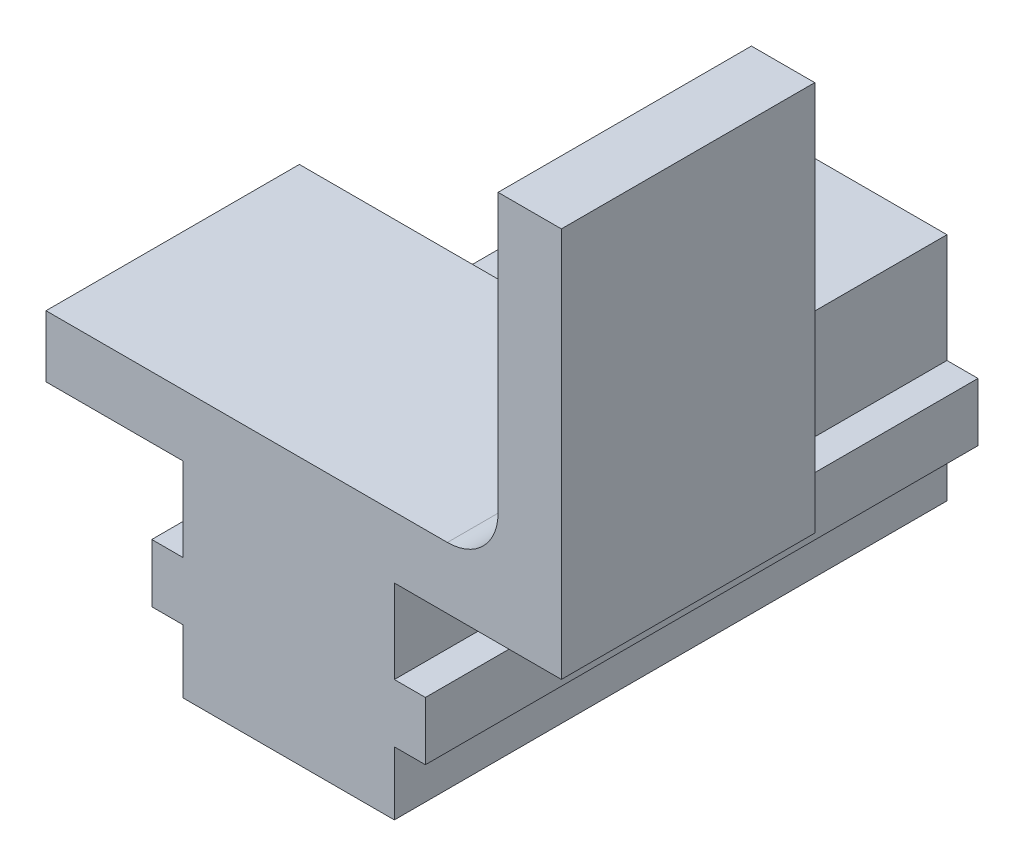
ISO-10303-21;
HEADER;
FILE_DESCRIPTION(('STEP AP214'),'2;1');
FILE_NAME('part.step','',(''),(''),'','','');
FILE_SCHEMA(('AUTOMOTIVE_DESIGN { 1 0 10303 214 1 1 1 1 }'));
ENDSEC;
DATA;
#1=APPLICATION_CONTEXT('core data for automotive mechanical design processes');
#2=APPLICATION_PROTOCOL_DEFINITION('international standard','automotive_design',2000,#1);
#3=PRODUCT_CONTEXT('',#1,'mechanical');
#4=PRODUCT('Part','Part','',(#3));
#5=PRODUCT_RELATED_PRODUCT_CATEGORY('part','',(#4));
#6=PRODUCT_DEFINITION_FORMATION('','',#4);
#7=PRODUCT_DEFINITION_CONTEXT('part definition',#1,'design');
#8=PRODUCT_DEFINITION('design','',#6,#7);
#9=PRODUCT_DEFINITION_SHAPE('','',#8);
#10=(LENGTH_UNIT() NAMED_UNIT(*) SI_UNIT(.MILLI.,.METRE.));
#11=(NAMED_UNIT(*) PLANE_ANGLE_UNIT() SI_UNIT($,.RADIAN.));
#12=(NAMED_UNIT(*) SI_UNIT($,.STERADIAN.) SOLID_ANGLE_UNIT());
#13=UNCERTAINTY_MEASURE_WITH_UNIT(LENGTH_MEASURE(1.E-05),#10,'distance_accuracy_value','');
#14=(GEOMETRIC_REPRESENTATION_CONTEXT(3) GLOBAL_UNCERTAINTY_ASSIGNED_CONTEXT((#13)) GLOBAL_UNIT_ASSIGNED_CONTEXT((#10,
#11,#12)) REPRESENTATION_CONTEXT('',''));
#15=CARTESIAN_POINT('',(0.,0.,0.));
#16=DIRECTION('',(0.,0.,1.));
#17=DIRECTION('',(1.,0.,0.));
#18=AXIS2_PLACEMENT_3D('',#15,#16,#17);
#19=CARTESIAN_POINT('',(0.,0.,0.));
#20=DIRECTION('',(0.,0.,-1.));
#21=DIRECTION('',(-1.,0.,0.));
#22=AXIS2_PLACEMENT_3D('',#19,#20,#21);
#23=PLANE('',#22);
#24=DIRECTION('',(-1.,0.,0.));
#25=VECTOR('',#24,1.);
#26=CARTESIAN_POINT('',(0.,2.54,0.));
#27=LINE('',#26,#25);
#28=CARTESIAN_POINT('',(10.6045,2.54,0.));
#29=VERTEX_POINT('',#28);
#30=CARTESIAN_POINT('',(0.,2.54,0.));
#31=VERTEX_POINT('',#30);
#32=EDGE_CURVE('E261',#29,#31,#27,.T.);
#33=ORIENTED_EDGE('',*,*,#32,.T.);
#34=DIRECTION('',(0.,-1.,0.));
#35=VECTOR('',#34,1.);
#36=CARTESIAN_POINT('',(0.,0.,0.));
#37=LINE('',#36,#35);
#38=CARTESIAN_POINT('',(0.,0.,0.));
#39=VERTEX_POINT('',#38);
#40=EDGE_CURVE('E217',#31,#39,#37,.T.);
#41=ORIENTED_EDGE('',*,*,#40,.T.);
#42=DIRECTION('',(1.,0.,0.));
#43=VECTOR('',#42,1.);
#44=CARTESIAN_POINT('',(-6.858,0.,0.));
#45=LINE('',#44,#43);
#46=CARTESIAN_POINT('',(-6.858,0.,0.));
#47=VERTEX_POINT('',#46);
#48=EDGE_CURVE('E266',#47,#39,#45,.T.);
#49=ORIENTED_EDGE('',*,*,#48,.F.);
#50=DIRECTION('',(0.,-1.,0.));
#51=VECTOR('',#50,1.);
#52=CARTESIAN_POINT('',(-6.858,3.089,0.));
#53=LINE('',#52,#51);
#54=CARTESIAN_POINT('',(-6.858,3.089,0.));
#55=VERTEX_POINT('',#54);
#56=EDGE_CURVE('E274',#55,#47,#53,.T.);
#57=ORIENTED_EDGE('',*,*,#56,.F.);
#58=DIRECTION('',(-1.,0.,0.));
#59=VECTOR('',#58,1.);
#60=CARTESIAN_POINT('',(15.80225,3.089,0.));
#61=LINE('',#60,#59);
#62=CARTESIAN_POINT('',(13.26225,3.089,0.));
#63=VERTEX_POINT('',#62);
#64=EDGE_CURVE('E342',#63,#55,#61,.T.);
#65=ORIENTED_EDGE('',*,*,#64,.F.);
#66=CARTESIAN_POINT('',(13.26225,5.629,0.));
#67=DIRECTION('',(0.,0.,-1.));
#68=DIRECTION('',(-1.,0.,0.));
#69=AXIS2_PLACEMENT_3D('',#66,#67,#68);
#70=CIRCLE('',#69,2.54);
#71=CARTESIAN_POINT('',(15.80225,5.629,0.));
#72=VERTEX_POINT('',#71);
#73=EDGE_CURVE('E405',#63,#72,#70,.F.);
#74=ORIENTED_EDGE('',*,*,#73,.T.);
#75=DIRECTION('',(0.,-1.,0.));
#76=VECTOR('',#75,1.);
#77=CARTESIAN_POINT('',(15.80225,19.558,0.));
#78=LINE('',#77,#76);
#79=CARTESIAN_POINT('',(15.80225,19.558,0.));
#80=VERTEX_POINT('',#79);
#81=EDGE_CURVE('E338',#80,#72,#78,.T.);
#82=ORIENTED_EDGE('',*,*,#81,.F.);
#83=DIRECTION('',(-1.,0.,0.));
#84=VECTOR('',#83,1.);
#85=CARTESIAN_POINT('',(18.97725,19.558,0.));
#86=LINE('',#85,#84);
#87=CARTESIAN_POINT('',(18.97725,19.558,0.));
#88=VERTEX_POINT('',#87);
#89=EDGE_CURVE('E335',#88,#80,#86,.T.);
#90=ORIENTED_EDGE('',*,*,#89,.F.);
#91=DIRECTION('',(0.,1.,0.));
#92=VECTOR('',#91,1.);
#93=CARTESIAN_POINT('',(18.97725,0.,0.));
#94=LINE('',#93,#92);
#95=CARTESIAN_POINT('',(18.97725,0.,0.));
#96=VERTEX_POINT('',#95);
#97=EDGE_CURVE('E332',#96,#88,#94,.T.);
#98=ORIENTED_EDGE('',*,*,#97,.F.);
#99=DIRECTION('',(1.,0.,0.));
#100=VECTOR('',#99,1.);
#101=CARTESIAN_POINT('',(10.6045,0.,0.));
#102=LINE('',#101,#100);
#103=CARTESIAN_POINT('',(10.6045,0.,0.));
#104=VERTEX_POINT('',#103);
#105=EDGE_CURVE('E329',#104,#96,#102,.T.);
#106=ORIENTED_EDGE('',*,*,#105,.F.);
#107=DIRECTION('',(0.,1.,0.));
#108=VECTOR('',#107,1.);
#109=CARTESIAN_POINT('',(10.6045,1.27,0.));
#110=LINE('',#109,#108);
#111=EDGE_CURVE('E259',#104,#29,#110,.T.);
#112=ORIENTED_EDGE('',*,*,#111,.T.);
#113=EDGE_LOOP('',(#33,#41,#49,#57,#65,#74,#82,#90,#98,#106,#112));
#114=FACE_BOUND('',#113,.T.);
#115=ADVANCED_FACE('F39',(#114),#23,.T.);
#116=CARTESIAN_POINT('',(-6.858,0.,12.7));
#117=DIRECTION('',(0.,1.,0.));
#118=DIRECTION('',(0.,0.,1.));
#119=AXIS2_PLACEMENT_3D('',#116,#117,#118);
#120=PLANE('',#119);
#121=ORIENTED_EDGE('',*,*,#48,.T.);
#122=DIRECTION('',(0.,0.,-1.));
#123=VECTOR('',#122,1.);
#124=CARTESIAN_POINT('',(0.,0.,12.7));
#125=LINE('',#124,#123);
#126=CARTESIAN_POINT('',(0.,0.,12.7));
#127=VERTEX_POINT('',#126);
#128=EDGE_CURVE('E199',#127,#39,#125,.T.);
#129=ORIENTED_EDGE('',*,*,#128,.F.);
#130=DIRECTION('',(1.,0.,0.));
#131=VECTOR('',#130,1.);
#132=CARTESIAN_POINT('',(-6.858,0.,12.7));
#133=LINE('',#132,#131);
#134=CARTESIAN_POINT('',(-6.858,0.,12.7));
#135=VERTEX_POINT('',#134);
#136=EDGE_CURVE('E269',#135,#127,#133,.T.);
#137=ORIENTED_EDGE('',*,*,#136,.F.);
#138=DIRECTION('',(0.,0.,-1.));
#139=VECTOR('',#138,1.);
#140=CARTESIAN_POINT('',(-6.858,0.,12.7));
#141=LINE('',#140,#139);
#142=EDGE_CURVE('E325',#135,#47,#141,.T.);
#143=ORIENTED_EDGE('',*,*,#142,.T.);
#144=EDGE_LOOP('',(#121,#129,#137,#143));
#145=FACE_BOUND('',#144,.T.);
#146=ADVANCED_FACE('F470',(#145),#120,.F.);
#147=CARTESIAN_POINT('',(0.,0.,12.7));
#148=DIRECTION('',(1.,0.,0.));
#149=DIRECTION('',(0.,1.,0.));
#150=AXIS2_PLACEMENT_3D('',#147,#148,#149);
#151=PLANE('',#150);
#152=ORIENTED_EDGE('',*,*,#128,.T.);
#153=ORIENTED_EDGE('',*,*,#40,.F.);
#154=CARTESIAN_POINT('',(0.,2.54,-1.27));
#155=DIRECTION('',(1.,0.,0.));
#156=DIRECTION('',(0.,1.,0.));
#157=AXIS2_PLACEMENT_3D('',#154,#155,#156);
#158=CIRCLE('',#157,1.27);
#159=CARTESIAN_POINT('',(0.,1.27,-1.27));
#160=VERTEX_POINT('',#159);
#161=EDGE_CURVE('E48',#31,#160,#158,.T.);
#162=ORIENTED_EDGE('',*,*,#161,.T.);
#163=DIRECTION('',(0.,0.,1.));
#164=VECTOR('',#163,1.);
#165=CARTESIAN_POINT('',(0.,1.27,-15.));
#166=LINE('',#165,#164);
#167=CARTESIAN_POINT('',(0.,1.27,-15.));
#168=VERTEX_POINT('',#167);
#169=EDGE_CURVE('E214',#168,#160,#166,.T.);
#170=ORIENTED_EDGE('',*,*,#169,.F.);
#171=DIRECTION('',(0.,-1.,0.));
#172=VECTOR('',#171,1.);
#173=CARTESIAN_POINT('',(0.,0.,-15.));
#174=LINE('',#173,#172);
#175=CARTESIAN_POINT('',(0.,-4.191,-15.));
#176=VERTEX_POINT('',#175);
#177=EDGE_CURVE('E206',#168,#176,#174,.T.);
#178=ORIENTED_EDGE('',*,*,#177,.T.);
#179=DIRECTION('',(0.,0.,-1.));
#180=VECTOR('',#179,1.);
#181=CARTESIAN_POINT('',(0.,-4.191,12.7));
#182=LINE('',#181,#180);
#183=CARTESIAN_POINT('',(0.,-4.191,12.7));
#184=VERTEX_POINT('',#183);
#185=EDGE_CURVE('E191',#184,#176,#182,.T.);
#186=ORIENTED_EDGE('',*,*,#185,.F.);
#187=DIRECTION('',(0.,-1.,0.));
#188=VECTOR('',#187,1.);
#189=CARTESIAN_POINT('',(0.,0.,12.7));
#190=LINE('',#189,#188);
#191=EDGE_CURVE('E273',#127,#184,#190,.T.);
#192=ORIENTED_EDGE('',*,*,#191,.F.);
#193=EDGE_LOOP('',(#152,#153,#162,#170,#178,#186,#192));
#194=FACE_BOUND('',#193,.T.);
#195=ADVANCED_FACE('F213',(#194),#151,.F.);
#196=CARTESIAN_POINT('',(0.,-4.191,12.7));
#197=DIRECTION('',(0.,-1.,0.));
#198=DIRECTION('',(1.,0.,0.));
#199=AXIS2_PLACEMENT_3D('',#196,#197,#198);
#200=PLANE('',#199);
#201=ORIENTED_EDGE('',*,*,#185,.T.);
#202=DIRECTION('',(-1.,0.,0.));
#203=VECTOR('',#202,1.);
#204=CARTESIAN_POINT('',(0.,-4.191,-15.));
#205=LINE('',#204,#203);
#206=CARTESIAN_POINT('',(-1.55575,-4.191,-15.));
#207=VERTEX_POINT('',#206);
#208=EDGE_CURVE('E195',#176,#207,#205,.T.);
#209=ORIENTED_EDGE('',*,*,#208,.T.);
#210=DIRECTION('',(0.,0.,-1.));
#211=VECTOR('',#210,1.);
#212=CARTESIAN_POINT('',(-1.55575,-4.191,12.7));
#213=LINE('',#212,#211);
#214=CARTESIAN_POINT('',(-1.55575,-4.191,12.7));
#215=VERTEX_POINT('',#214);
#216=EDGE_CURVE('E200',#215,#207,#213,.T.);
#217=ORIENTED_EDGE('',*,*,#216,.F.);
#218=DIRECTION('',(-1.,0.,0.));
#219=VECTOR('',#218,1.);
#220=CARTESIAN_POINT('',(0.,-4.191,12.7));
#221=LINE('',#220,#219);
#222=EDGE_CURVE('E196',#184,#215,#221,.T.);
#223=ORIENTED_EDGE('',*,*,#222,.F.);
#224=EDGE_LOOP('',(#201,#209,#217,#223));
#225=FACE_BOUND('',#224,.T.);
#226=ADVANCED_FACE('F193',(#225),#200,.F.);
#227=CARTESIAN_POINT('',(-1.55575,-4.191,12.7));
#228=DIRECTION('',(1.,0.,0.));
#229=DIRECTION('',(0.,0.,-1.));
#230=AXIS2_PLACEMENT_3D('',#227,#228,#229);
#231=PLANE('',#230);
#232=ORIENTED_EDGE('',*,*,#216,.T.);
#233=DIRECTION('',(0.,-1.,0.));
#234=VECTOR('',#233,1.);
#235=CARTESIAN_POINT('',(-1.55575,-4.191,-15.));
#236=LINE('',#235,#234);
#237=CARTESIAN_POINT('',(-1.55575,-7.112,-15.));
#238=VERTEX_POINT('',#237);
#239=EDGE_CURVE('E209',#207,#238,#236,.T.);
#240=ORIENTED_EDGE('',*,*,#239,.T.);
#241=DIRECTION('',(0.,0.,-1.));
#242=VECTOR('',#241,1.);
#243=CARTESIAN_POINT('',(-1.55575,-7.112,12.7));
#244=LINE('',#243,#242);
#245=CARTESIAN_POINT('',(-1.55575,-7.112,12.7));
#246=VERTEX_POINT('',#245);
#247=EDGE_CURVE('E391',#246,#238,#244,.T.);
#248=ORIENTED_EDGE('',*,*,#247,.F.);
#249=DIRECTION('',(0.,-1.,0.));
#250=VECTOR('',#249,1.);
#251=CARTESIAN_POINT('',(-1.55575,-4.191,12.7));
#252=LINE('',#251,#250);
#253=EDGE_CURVE('E279',#215,#246,#252,.T.);
#254=ORIENTED_EDGE('',*,*,#253,.F.);
#255=EDGE_LOOP('',(#232,#240,#248,#254));
#256=FACE_BOUND('',#255,.T.);
#257=ADVANCED_FACE('F464',(#256),#231,.F.);
#258=CARTESIAN_POINT('',(-1.55575,-7.112,12.7));
#259=DIRECTION('',(0.,1.,0.));
#260=DIRECTION('',(0.,0.,1.));
#261=AXIS2_PLACEMENT_3D('',#258,#259,#260);
#262=PLANE('',#261);
#263=ORIENTED_EDGE('',*,*,#247,.T.);
#264=DIRECTION('',(1.,0.,0.));
#265=VECTOR('',#264,1.);
#266=CARTESIAN_POINT('',(-1.55575,-7.112,-15.));
#267=LINE('',#266,#265);
#268=CARTESIAN_POINT('',(0.,-7.112,-15.));
#269=VERTEX_POINT('',#268);
#270=EDGE_CURVE('E224',#238,#269,#267,.T.);
#271=ORIENTED_EDGE('',*,*,#270,.T.);
#272=DIRECTION('',(0.,0.,-1.));
#273=VECTOR('',#272,1.);
#274=CARTESIAN_POINT('',(0.,-7.112,12.7));
#275=LINE('',#274,#273);
#276=CARTESIAN_POINT('',(0.,-7.112,12.7));
#277=VERTEX_POINT('',#276);
#278=EDGE_CURVE('E388',#277,#269,#275,.T.);
#279=ORIENTED_EDGE('',*,*,#278,.F.);
#280=DIRECTION('',(1.,0.,0.));
#281=VECTOR('',#280,1.);
#282=CARTESIAN_POINT('',(-1.55575,-7.112,12.7));
#283=LINE('',#282,#281);
#284=EDGE_CURVE('E282',#246,#277,#283,.T.);
#285=ORIENTED_EDGE('',*,*,#284,.F.);
#286=EDGE_LOOP('',(#263,#271,#279,#285));
#287=FACE_BOUND('',#286,.T.);
#288=ADVANCED_FACE('F459',(#287),#262,.F.);
#289=CARTESIAN_POINT('',(0.,-7.112,12.7));
#290=DIRECTION('',(1.,0.,0.));
#291=DIRECTION('',(0.,1.,0.));
#292=AXIS2_PLACEMENT_3D('',#289,#290,#291);
#293=PLANE('',#292);
#294=ORIENTED_EDGE('',*,*,#278,.T.);
#295=DIRECTION('',(0.,-1.,0.));
#296=VECTOR('',#295,1.);
#297=CARTESIAN_POINT('',(0.,-7.112,-15.));
#298=LINE('',#297,#296);
#299=CARTESIAN_POINT('',(0.,-10.287,-15.));
#300=VERTEX_POINT('',#299);
#301=EDGE_CURVE('E228',#269,#300,#298,.T.);
#302=ORIENTED_EDGE('',*,*,#301,.T.);
#303=DIRECTION('',(0.,0.,-1.));
#304=VECTOR('',#303,1.);
#305=CARTESIAN_POINT('',(0.,-10.287,12.7));
#306=LINE('',#305,#304);
#307=CARTESIAN_POINT('',(0.,-10.287,12.7));
#308=VERTEX_POINT('',#307);
#309=EDGE_CURVE('E385',#308,#300,#306,.T.);
#310=ORIENTED_EDGE('',*,*,#309,.F.);
#311=DIRECTION('',(0.,-1.,0.));
#312=VECTOR('',#311,1.);
#313=CARTESIAN_POINT('',(0.,-7.112,12.7));
#314=LINE('',#313,#312);
#315=EDGE_CURVE('E285',#277,#308,#314,.T.);
#316=ORIENTED_EDGE('',*,*,#315,.F.);
#317=EDGE_LOOP('',(#294,#302,#310,#316));
#318=FACE_BOUND('',#317,.T.);
#319=ADVANCED_FACE('F456',(#318),#293,.F.);
#320=CARTESIAN_POINT('',(0.,-10.287,12.7));
#321=DIRECTION('',(0.,1.,0.));
#322=DIRECTION('',(0.,0.,1.));
#323=AXIS2_PLACEMENT_3D('',#320,#321,#322);
#324=PLANE('',#323);
#325=ORIENTED_EDGE('',*,*,#309,.T.);
#326=DIRECTION('',(1.,0.,0.));
#327=VECTOR('',#326,1.);
#328=CARTESIAN_POINT('',(0.,-10.287,-15.));
#329=LINE('',#328,#327);
#330=CARTESIAN_POINT('',(10.6045,-10.287,-15.));
#331=VERTEX_POINT('',#330);
#332=EDGE_CURVE('E232',#300,#331,#329,.T.);
#333=ORIENTED_EDGE('',*,*,#332,.T.);
#334=DIRECTION('',(0.,0.,-1.));
#335=VECTOR('',#334,1.);
#336=CARTESIAN_POINT('',(10.6045,-10.287,12.7));
#337=LINE('',#336,#335);
#338=CARTESIAN_POINT('',(10.6045,-10.287,12.7));
#339=VERTEX_POINT('',#338);
#340=EDGE_CURVE('E382',#339,#331,#337,.T.);
#341=ORIENTED_EDGE('',*,*,#340,.F.);
#342=DIRECTION('',(1.,0.,0.));
#343=VECTOR('',#342,1.);
#344=CARTESIAN_POINT('',(0.,-10.287,12.7));
#345=LINE('',#344,#343);
#346=EDGE_CURVE('E288',#308,#339,#345,.T.);
#347=ORIENTED_EDGE('',*,*,#346,.F.);
#348=EDGE_LOOP('',(#325,#333,#341,#347));
#349=FACE_BOUND('',#348,.T.);
#350=ADVANCED_FACE('F451',(#349),#324,.F.);
#351=CARTESIAN_POINT('',(10.6045,-10.287,12.7));
#352=DIRECTION('',(-1.,0.,0.));
#353=DIRECTION('',(0.,0.,1.));
#354=AXIS2_PLACEMENT_3D('',#351,#352,#353);
#355=PLANE('',#354);
#356=ORIENTED_EDGE('',*,*,#340,.T.);
#357=DIRECTION('',(0.,1.,0.));
#358=VECTOR('',#357,1.);
#359=CARTESIAN_POINT('',(10.6045,-10.287,-15.));
#360=LINE('',#359,#358);
#361=CARTESIAN_POINT('',(10.6045,-7.112,-15.));
#362=VERTEX_POINT('',#361);
#363=EDGE_CURVE('E236',#331,#362,#360,.T.);
#364=ORIENTED_EDGE('',*,*,#363,.T.);
#365=DIRECTION('',(0.,0.,-1.));
#366=VECTOR('',#365,1.);
#367=CARTESIAN_POINT('',(10.6045,-7.112,12.7));
#368=LINE('',#367,#366);
#369=CARTESIAN_POINT('',(10.6045,-7.112,12.7));
#370=VERTEX_POINT('',#369);
#371=EDGE_CURVE('E379',#370,#362,#368,.T.);
#372=ORIENTED_EDGE('',*,*,#371,.F.);
#373=DIRECTION('',(0.,1.,0.));
#374=VECTOR('',#373,1.);
#375=CARTESIAN_POINT('',(10.6045,-10.287,12.7));
#376=LINE('',#375,#374);
#377=EDGE_CURVE('E291',#339,#370,#376,.T.);
#378=ORIENTED_EDGE('',*,*,#377,.F.);
#379=EDGE_LOOP('',(#356,#364,#372,#378));
#380=FACE_BOUND('',#379,.T.);
#381=ADVANCED_FACE('F446',(#380),#355,.F.);
#382=CARTESIAN_POINT('',(10.6045,-7.112,12.7));
#383=DIRECTION('',(0.,1.,0.));
#384=DIRECTION('',(0.,0.,1.));
#385=AXIS2_PLACEMENT_3D('',#382,#383,#384);
#386=PLANE('',#385);
#387=ORIENTED_EDGE('',*,*,#371,.T.);
#388=DIRECTION('',(1.,0.,0.));
#389=VECTOR('',#388,1.);
#390=CARTESIAN_POINT('',(10.6045,-7.112,-15.));
#391=LINE('',#390,#389);
#392=CARTESIAN_POINT('',(12.16025,-7.112,-15.));
#393=VERTEX_POINT('',#392);
#394=EDGE_CURVE('E240',#362,#393,#391,.T.);
#395=ORIENTED_EDGE('',*,*,#394,.T.);
#396=DIRECTION('',(0.,0.,-1.));
#397=VECTOR('',#396,1.);
#398=CARTESIAN_POINT('',(12.16025,-7.112,12.7));
#399=LINE('',#398,#397);
#400=CARTESIAN_POINT('',(12.16025,-7.112,12.7));
#401=VERTEX_POINT('',#400);
#402=EDGE_CURVE('E376',#401,#393,#399,.T.);
#403=ORIENTED_EDGE('',*,*,#402,.F.);
#404=DIRECTION('',(1.,0.,0.));
#405=VECTOR('',#404,1.);
#406=CARTESIAN_POINT('',(10.6045,-7.112,12.7));
#407=LINE('',#406,#405);
#408=EDGE_CURVE('E294',#370,#401,#407,.T.);
#409=ORIENTED_EDGE('',*,*,#408,.F.);
#410=EDGE_LOOP('',(#387,#395,#403,#409));
#411=FACE_BOUND('',#410,.T.);
#412=ADVANCED_FACE('F441',(#411),#386,.F.);
#413=CARTESIAN_POINT('',(12.16025,-7.112,12.7));
#414=DIRECTION('',(-1.,0.,0.));
#415=DIRECTION('',(0.,0.,1.));
#416=AXIS2_PLACEMENT_3D('',#413,#414,#415);
#417=PLANE('',#416);
#418=ORIENTED_EDGE('',*,*,#402,.T.);
#419=DIRECTION('',(0.,1.,0.));
#420=VECTOR('',#419,1.);
#421=CARTESIAN_POINT('',(12.16025,-7.112,-15.));
#422=LINE('',#421,#420);
#423=CARTESIAN_POINT('',(12.16025,-4.191,-15.));
#424=VERTEX_POINT('',#423);
#425=EDGE_CURVE('E244',#393,#424,#422,.T.);
#426=ORIENTED_EDGE('',*,*,#425,.T.);
#427=DIRECTION('',(0.,0.,-1.));
#428=VECTOR('',#427,1.);
#429=CARTESIAN_POINT('',(12.16025,-4.191,12.7));
#430=LINE('',#429,#428);
#431=CARTESIAN_POINT('',(12.16025,-4.191,12.7));
#432=VERTEX_POINT('',#431);
#433=EDGE_CURVE('E373',#432,#424,#430,.T.);
#434=ORIENTED_EDGE('',*,*,#433,.F.);
#435=DIRECTION('',(0.,1.,0.));
#436=VECTOR('',#435,1.);
#437=CARTESIAN_POINT('',(12.16025,-7.112,12.7));
#438=LINE('',#437,#436);
#439=EDGE_CURVE('E297',#401,#432,#438,.T.);
#440=ORIENTED_EDGE('',*,*,#439,.F.);
#441=EDGE_LOOP('',(#418,#426,#434,#440));
#442=FACE_BOUND('',#441,.T.);
#443=ADVANCED_FACE('F436',(#442),#417,.F.);
#444=CARTESIAN_POINT('',(12.16025,-4.191,12.7));
#445=DIRECTION('',(0.,-1.,0.));
#446=DIRECTION('',(1.,0.,0.));
#447=AXIS2_PLACEMENT_3D('',#444,#445,#446);
#448=PLANE('',#447);
#449=ORIENTED_EDGE('',*,*,#433,.T.);
#450=DIRECTION('',(-1.,0.,0.));
#451=VECTOR('',#450,1.);
#452=CARTESIAN_POINT('',(12.16025,-4.191,-15.));
#453=LINE('',#452,#451);
#454=CARTESIAN_POINT('',(10.6045,-4.191,-15.));
#455=VERTEX_POINT('',#454);
#456=EDGE_CURVE('E248',#424,#455,#453,.T.);
#457=ORIENTED_EDGE('',*,*,#456,.T.);
#458=DIRECTION('',(0.,0.,-1.));
#459=VECTOR('',#458,1.);
#460=CARTESIAN_POINT('',(10.6045,-4.191,12.7));
#461=LINE('',#460,#459);
#462=CARTESIAN_POINT('',(10.6045,-4.191,12.7));
#463=VERTEX_POINT('',#462);
#464=EDGE_CURVE('E370',#463,#455,#461,.T.);
#465=ORIENTED_EDGE('',*,*,#464,.F.);
#466=DIRECTION('',(-1.,0.,0.));
#467=VECTOR('',#466,1.);
#468=CARTESIAN_POINT('',(12.16025,-4.191,12.7));
#469=LINE('',#468,#467);
#470=EDGE_CURVE('E300',#432,#463,#469,.T.);
#471=ORIENTED_EDGE('',*,*,#470,.F.);
#472=EDGE_LOOP('',(#449,#457,#465,#471));
#473=FACE_BOUND('',#472,.T.);
#474=ADVANCED_FACE('F430',(#473),#448,.F.);
#475=CARTESIAN_POINT('',(10.6045,-4.191,12.7));
#476=DIRECTION('',(-1.,0.,0.));
#477=DIRECTION('',(0.,0.,1.));
#478=AXIS2_PLACEMENT_3D('',#475,#476,#477);
#479=PLANE('',#478);
#480=ORIENTED_EDGE('',*,*,#464,.T.);
#481=DIRECTION('',(0.,1.,0.));
#482=VECTOR('',#481,1.);
#483=CARTESIAN_POINT('',(10.6045,-4.191,-15.));
#484=LINE('',#483,#482);
#485=CARTESIAN_POINT('',(10.6045,1.27,-15.));
#486=VERTEX_POINT('',#485);
#487=EDGE_CURVE('E252',#455,#486,#484,.T.);
#488=ORIENTED_EDGE('',*,*,#487,.T.);
#489=DIRECTION('',(0.,0.,1.));
#490=VECTOR('',#489,1.);
#491=CARTESIAN_POINT('',(10.6045,1.27,-15.));
#492=LINE('',#491,#490);
#493=CARTESIAN_POINT('',(10.6045,1.27,-1.27));
#494=VERTEX_POINT('',#493);
#495=EDGE_CURVE('E258',#486,#494,#492,.T.);
#496=ORIENTED_EDGE('',*,*,#495,.T.);
#497=CARTESIAN_POINT('',(10.6045,2.54,-1.27));
#498=DIRECTION('',(-1.,0.,0.));
#499=DIRECTION('',(0.,0.,1.));
#500=AXIS2_PLACEMENT_3D('',#497,#498,#499);
#501=CIRCLE('',#500,1.27);
#502=EDGE_CURVE('E11',#494,#29,#501,.T.);
#503=ORIENTED_EDGE('',*,*,#502,.T.);
#504=ORIENTED_EDGE('',*,*,#111,.F.);
#505=DIRECTION('',(0.,0.,-1.));
#506=VECTOR('',#505,1.);
#507=CARTESIAN_POINT('',(10.6045,0.,12.7));
#508=LINE('',#507,#506);
#509=CARTESIAN_POINT('',(10.6045,0.,12.7));
#510=VERTEX_POINT('',#509);
#511=EDGE_CURVE('E366',#510,#104,#508,.T.);
#512=ORIENTED_EDGE('',*,*,#511,.F.);
#513=DIRECTION('',(0.,1.,0.));
#514=VECTOR('',#513,1.);
#515=CARTESIAN_POINT('',(10.6045,-4.191,12.7));
#516=LINE('',#515,#514);
#517=EDGE_CURVE('E303',#463,#510,#516,.T.);
#518=ORIENTED_EDGE('',*,*,#517,.F.);
#519=EDGE_LOOP('',(#480,#488,#496,#503,#504,#512,#518));
#520=FACE_BOUND('',#519,.T.);
#521=ADVANCED_FACE('F422',(#520),#479,.F.);
#522=CARTESIAN_POINT('',(10.6045,0.,12.7));
#523=DIRECTION('',(0.,1.,0.));
#524=DIRECTION('',(0.,0.,1.));
#525=AXIS2_PLACEMENT_3D('',#522,#523,#524);
#526=PLANE('',#525);
#527=ORIENTED_EDGE('',*,*,#105,.T.);
#528=DIRECTION('',(0.,0.,-1.));
#529=VECTOR('',#528,1.);
#530=CARTESIAN_POINT('',(18.97725,0.,12.7));
#531=LINE('',#530,#529);
#532=CARTESIAN_POINT('',(18.97725,0.,12.7));
#533=VERTEX_POINT('',#532);
#534=EDGE_CURVE('E362',#533,#96,#531,.T.);
#535=ORIENTED_EDGE('',*,*,#534,.F.);
#536=DIRECTION('',(1.,0.,0.));
#537=VECTOR('',#536,1.);
#538=CARTESIAN_POINT('',(10.6045,0.,12.7));
#539=LINE('',#538,#537);
#540=EDGE_CURVE('E306',#510,#533,#539,.T.);
#541=ORIENTED_EDGE('',*,*,#540,.F.);
#542=ORIENTED_EDGE('',*,*,#511,.T.);
#543=EDGE_LOOP('',(#527,#535,#541,#542));
#544=FACE_BOUND('',#543,.T.);
#545=ADVANCED_FACE('F503',(#544),#526,.F.);
#546=CARTESIAN_POINT('',(18.97725,0.,12.7));
#547=DIRECTION('',(-1.,0.,0.));
#548=DIRECTION('',(0.,-1.,0.));
#549=AXIS2_PLACEMENT_3D('',#546,#547,#548);
#550=PLANE('',#549);
#551=ORIENTED_EDGE('',*,*,#97,.T.);
#552=DIRECTION('',(0.,0.,-1.));
#553=VECTOR('',#552,1.);
#554=CARTESIAN_POINT('',(18.97725,19.558,12.7));
#555=LINE('',#554,#553);
#556=CARTESIAN_POINT('',(18.97725,19.558,12.7));
#557=VERTEX_POINT('',#556);
#558=EDGE_CURVE('E358',#557,#88,#555,.T.);
#559=ORIENTED_EDGE('',*,*,#558,.F.);
#560=DIRECTION('',(0.,1.,0.));
#561=VECTOR('',#560,1.);
#562=CARTESIAN_POINT('',(18.97725,0.,12.7));
#563=LINE('',#562,#561);
#564=EDGE_CURVE('E309',#533,#557,#563,.T.);
#565=ORIENTED_EDGE('',*,*,#564,.F.);
#566=ORIENTED_EDGE('',*,*,#534,.T.);
#567=EDGE_LOOP('',(#551,#559,#565,#566));
#568=FACE_BOUND('',#567,.T.);
#569=ADVANCED_FACE('F498',(#568),#550,.F.);
#570=CARTESIAN_POINT('',(18.97725,19.558,12.7));
#571=DIRECTION('',(0.,-1.,0.));
#572=DIRECTION('',(0.,0.,-1.));
#573=AXIS2_PLACEMENT_3D('',#570,#571,#572);
#574=PLANE('',#573);
#575=ORIENTED_EDGE('',*,*,#89,.T.);
#576=DIRECTION('',(0.,0.,-1.));
#577=VECTOR('',#576,1.);
#578=CARTESIAN_POINT('',(15.80225,19.558,12.7));
#579=LINE('',#578,#577);
#580=CARTESIAN_POINT('',(15.80225,19.558,12.7));
#581=VERTEX_POINT('',#580);
#582=EDGE_CURVE('E354',#581,#80,#579,.T.);
#583=ORIENTED_EDGE('',*,*,#582,.F.);
#584=DIRECTION('',(-1.,0.,0.));
#585=VECTOR('',#584,1.);
#586=CARTESIAN_POINT('',(18.97725,19.558,12.7));
#587=LINE('',#586,#585);
#588=EDGE_CURVE('E312',#557,#581,#587,.T.);
#589=ORIENTED_EDGE('',*,*,#588,.F.);
#590=ORIENTED_EDGE('',*,*,#558,.T.);
#591=EDGE_LOOP('',(#575,#583,#589,#590));
#592=FACE_BOUND('',#591,.T.);
#593=ADVANCED_FACE('F494',(#592),#574,.F.);
#594=CARTESIAN_POINT('',(15.80225,19.558,12.7));
#595=DIRECTION('',(1.,0.,0.));
#596=DIRECTION('',(0.,0.,-1.));
#597=AXIS2_PLACEMENT_3D('',#594,#595,#596);
#598=PLANE('',#597);
#599=ORIENTED_EDGE('',*,*,#81,.T.);
#600=DIRECTION('',(0.,0.,-1.));
#601=VECTOR('',#600,1.);
#602=CARTESIAN_POINT('',(15.80225,5.629,12.7));
#603=LINE('',#602,#601);
#604=CARTESIAN_POINT('',(15.80225,5.629,12.7));
#605=VERTEX_POINT('',#604);
#606=EDGE_CURVE('E402',#72,#605,#603,.F.);
#607=ORIENTED_EDGE('',*,*,#606,.T.);
#608=DIRECTION('',(0.,-1.,0.));
#609=VECTOR('',#608,1.);
#610=CARTESIAN_POINT('',(15.80225,19.558,12.7));
#611=LINE('',#610,#609);
#612=EDGE_CURVE('E315',#581,#605,#611,.T.);
#613=ORIENTED_EDGE('',*,*,#612,.F.);
#614=ORIENTED_EDGE('',*,*,#582,.T.);
#615=EDGE_LOOP('',(#599,#607,#613,#614));
#616=FACE_BOUND('',#615,.T.);
#617=ADVANCED_FACE('F489',(#616),#598,.F.);
#618=CARTESIAN_POINT('',(15.80225,3.089,12.7));
#619=DIRECTION('',(0.,-1.,0.));
#620=DIRECTION('',(1.,0.,0.));
#621=AXIS2_PLACEMENT_3D('',#618,#619,#620);
#622=PLANE('',#621);
#623=DIRECTION('',(-1.,0.,0.));
#624=VECTOR('',#623,1.);
#625=CARTESIAN_POINT('',(15.80225,3.089,12.7));
#626=LINE('',#625,#624);
#627=CARTESIAN_POINT('',(13.26225,3.089,12.7));
#628=VERTEX_POINT('',#627);
#629=CARTESIAN_POINT('',(-6.858,3.089,12.7));
#630=VERTEX_POINT('',#629);
#631=EDGE_CURVE('E319',#628,#630,#626,.T.);
#632=ORIENTED_EDGE('',*,*,#631,.F.);
#633=DIRECTION('',(0.,0.,-1.));
#634=VECTOR('',#633,1.);
#635=CARTESIAN_POINT('',(13.26225,3.089,0.));
#636=LINE('',#635,#634);
#637=EDGE_CURVE('E398',#628,#63,#636,.T.);
#638=ORIENTED_EDGE('',*,*,#637,.T.);
#639=ORIENTED_EDGE('',*,*,#64,.T.);
#640=DIRECTION('',(0.,0.,-1.));
#641=VECTOR('',#640,1.);
#642=CARTESIAN_POINT('',(-6.858,3.089,12.7));
#643=LINE('',#642,#641);
#644=EDGE_CURVE('E350',#630,#55,#643,.T.);
#645=ORIENTED_EDGE('',*,*,#644,.F.);
#646=EDGE_LOOP('',(#632,#638,#639,#645));
#647=FACE_BOUND('',#646,.T.);
#648=ADVANCED_FACE('F480',(#647),#622,.F.);
#649=CARTESIAN_POINT('',(-6.858,3.089,12.7));
#650=DIRECTION('',(1.,0.,0.));
#651=DIRECTION('',(0.,0.,-1.));
#652=AXIS2_PLACEMENT_3D('',#649,#650,#651);
#653=PLANE('',#652);
#654=ORIENTED_EDGE('',*,*,#56,.T.);
#655=ORIENTED_EDGE('',*,*,#142,.F.);
#656=DIRECTION('',(0.,-1.,0.));
#657=VECTOR('',#656,1.);
#658=CARTESIAN_POINT('',(-6.858,3.089,12.7));
#659=LINE('',#658,#657);
#660=EDGE_CURVE('E322',#630,#135,#659,.T.);
#661=ORIENTED_EDGE('',*,*,#660,.F.);
#662=ORIENTED_EDGE('',*,*,#644,.T.);
#663=EDGE_LOOP('',(#654,#655,#661,#662));
#664=FACE_BOUND('',#663,.T.);
#665=ADVANCED_FACE('F475',(#664),#653,.F.);
#666=CARTESIAN_POINT('',(0.,0.,12.7));
#667=DIRECTION('',(0.,0.,-1.));
#668=DIRECTION('',(-1.,0.,0.));
#669=AXIS2_PLACEMENT_3D('',#666,#667,#668);
#670=PLANE('',#669);
#671=ORIENTED_EDGE('',*,*,#136,.T.);
#672=ORIENTED_EDGE('',*,*,#191,.T.);
#673=ORIENTED_EDGE('',*,*,#222,.T.);
#674=ORIENTED_EDGE('',*,*,#253,.T.);
#675=ORIENTED_EDGE('',*,*,#284,.T.);
#676=ORIENTED_EDGE('',*,*,#315,.T.);
#677=ORIENTED_EDGE('',*,*,#346,.T.);
#678=ORIENTED_EDGE('',*,*,#377,.T.);
#679=ORIENTED_EDGE('',*,*,#408,.T.);
#680=ORIENTED_EDGE('',*,*,#439,.T.);
#681=ORIENTED_EDGE('',*,*,#470,.T.);
#682=ORIENTED_EDGE('',*,*,#517,.T.);
#683=ORIENTED_EDGE('',*,*,#540,.T.);
#684=ORIENTED_EDGE('',*,*,#564,.T.);
#685=ORIENTED_EDGE('',*,*,#588,.T.);
#686=ORIENTED_EDGE('',*,*,#612,.T.);
#687=CARTESIAN_POINT('',(13.26225,5.629,12.7));
#688=DIRECTION('',(0.,0.,-1.));
#689=DIRECTION('',(-1.,0.,0.));
#690=AXIS2_PLACEMENT_3D('',#687,#688,#689);
#691=CIRCLE('',#690,2.54);
#692=EDGE_CURVE('E262',#605,#628,#691,.T.);
#693=ORIENTED_EDGE('',*,*,#692,.T.);
#694=ORIENTED_EDGE('',*,*,#631,.T.);
#695=ORIENTED_EDGE('',*,*,#660,.T.);
#696=EDGE_LOOP('',(#671,#672,#673,#674,#675,#676,#677,#678,#679,#680,#681,#682,#683,#684,#685,
#686,#693,#694,#695));
#697=FACE_BOUND('',#696,.T.);
#698=ADVANCED_FACE('F466',(#697),#670,.F.);
#699=CARTESIAN_POINT('',(13.26225,5.629,12.7));
#700=DIRECTION('',(0.,0.,1.));
#701=DIRECTION('',(1.,0.,0.));
#702=AXIS2_PLACEMENT_3D('',#699,#700,#701);
#703=CYLINDRICAL_SURFACE('',#702,2.54);
#704=ORIENTED_EDGE('',*,*,#692,.F.);
#705=ORIENTED_EDGE('',*,*,#606,.F.);
#706=ORIENTED_EDGE('',*,*,#73,.F.);
#707=ORIENTED_EDGE('',*,*,#637,.F.);
#708=EDGE_LOOP('',(#704,#705,#706,#707));
#709=FACE_BOUND('',#708,.T.);
#710=ADVANCED_FACE('F484',(#709),#703,.F.);
#711=CARTESIAN_POINT('',(0.,1.27,-15.));
#712=DIRECTION('',(0.,1.,0.));
#713=DIRECTION('',(0.,0.,1.));
#714=AXIS2_PLACEMENT_3D('',#711,#712,#713);
#715=PLANE('',#714);
#716=ORIENTED_EDGE('',*,*,#169,.T.);
#717=DIRECTION('',(-1.,0.,0.));
#718=VECTOR('',#717,1.);
#719=CARTESIAN_POINT('',(10.6045,1.27,-1.27));
#720=LINE('',#719,#718);
#721=EDGE_CURVE('E61',#160,#494,#720,.F.);
#722=ORIENTED_EDGE('',*,*,#721,.T.);
#723=ORIENTED_EDGE('',*,*,#495,.F.);
#724=DIRECTION('',(-1.,0.,0.));
#725=VECTOR('',#724,1.);
#726=CARTESIAN_POINT('',(0.,1.27,-15.));
#727=LINE('',#726,#725);
#728=EDGE_CURVE('E255',#486,#168,#727,.T.);
#729=ORIENTED_EDGE('',*,*,#728,.T.);
#730=EDGE_LOOP('',(#716,#722,#723,#729));
#731=FACE_BOUND('',#730,.T.);
#732=ADVANCED_FACE('F425',(#731),#715,.T.);
#733=CARTESIAN_POINT('',(0.,0.,-15.));
#734=DIRECTION('',(0.,0.,-1.));
#735=DIRECTION('',(-1.,0.,0.));
#736=AXIS2_PLACEMENT_3D('',#733,#734,#735);
#737=PLANE('',#736);
#738=ORIENTED_EDGE('',*,*,#177,.F.);
#739=ORIENTED_EDGE('',*,*,#728,.F.);
#740=ORIENTED_EDGE('',*,*,#487,.F.);
#741=ORIENTED_EDGE('',*,*,#456,.F.);
#742=ORIENTED_EDGE('',*,*,#425,.F.);
#743=ORIENTED_EDGE('',*,*,#394,.F.);
#744=ORIENTED_EDGE('',*,*,#363,.F.);
#745=ORIENTED_EDGE('',*,*,#332,.F.);
#746=ORIENTED_EDGE('',*,*,#301,.F.);
#747=ORIENTED_EDGE('',*,*,#270,.F.);
#748=ORIENTED_EDGE('',*,*,#239,.F.);
#749=ORIENTED_EDGE('',*,*,#208,.F.);
#750=EDGE_LOOP('',(#738,#739,#740,#741,#742,#743,#744,#745,#746,#747,#748,#749));
#751=FACE_BOUND('',#750,.T.);
#752=ADVANCED_FACE('F204',(#751),#737,.T.);
#753=CARTESIAN_POINT('',(0.,2.54,-1.27));
#754=DIRECTION('',(1.,0.,0.));
#755=DIRECTION('',(0.,0.,-1.));
#756=AXIS2_PLACEMENT_3D('',#753,#754,#755);
#757=CYLINDRICAL_SURFACE('',#756,1.27);
#758=ORIENTED_EDGE('',*,*,#502,.F.);
#759=ORIENTED_EDGE('',*,*,#721,.F.);
#760=ORIENTED_EDGE('',*,*,#161,.F.);
#761=ORIENTED_EDGE('',*,*,#32,.F.);
#762=EDGE_LOOP('',(#758,#759,#760,#761));
#763=FACE_BOUND('',#762,.T.);
#764=ADVANCED_FACE('F41',(#763),#757,.F.);
#765=CLOSED_SHELL('',(#115,#146,#195,#226,#257,#288,#319,#350,#381,#412,#443,#474,#521,#545,
#569,#593,#617,#648,#665,#698,#710,#732,#752,#764));
#766=MANIFOLD_SOLID_BREP('B2',#765);
#767=ADVANCED_BREP_SHAPE_REPRESENTATION('',(#18,#766),#14);
#768=SHAPE_DEFINITION_REPRESENTATION(#9,#767);
ENDSEC;
END-ISO-10303-21;
